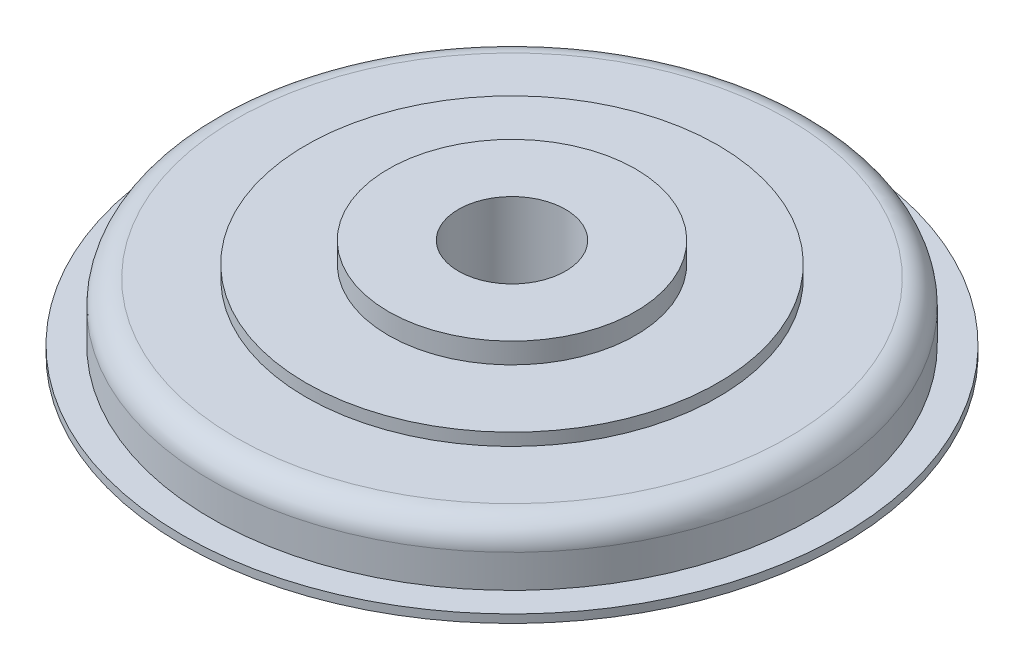
ISO-10303-21;
HEADER;
FILE_DESCRIPTION(('STEP AP214'),'2;1');
FILE_NAME('part.step','',(''),(''),'','','');
FILE_SCHEMA(('AUTOMOTIVE_DESIGN { 1 0 10303 214 1 1 1 1 }'));
ENDSEC;
DATA;
#1=APPLICATION_CONTEXT('core data for automotive mechanical design processes');
#2=APPLICATION_PROTOCOL_DEFINITION('international standard','automotive_design',2000,#1);
#3=PRODUCT_CONTEXT('',#1,'mechanical');
#4=PRODUCT('Part','Part','',(#3));
#5=PRODUCT_RELATED_PRODUCT_CATEGORY('part','',(#4));
#6=PRODUCT_DEFINITION_FORMATION('','',#4);
#7=PRODUCT_DEFINITION_CONTEXT('part definition',#1,'design');
#8=PRODUCT_DEFINITION('design','',#6,#7);
#9=PRODUCT_DEFINITION_SHAPE('','',#8);
#10=(LENGTH_UNIT() NAMED_UNIT(*) SI_UNIT(.MILLI.,.METRE.));
#11=(NAMED_UNIT(*) PLANE_ANGLE_UNIT() SI_UNIT($,.RADIAN.));
#12=(NAMED_UNIT(*) SI_UNIT($,.STERADIAN.) SOLID_ANGLE_UNIT());
#13=UNCERTAINTY_MEASURE_WITH_UNIT(LENGTH_MEASURE(1.E-05),#10,'distance_accuracy_value','');
#14=(GEOMETRIC_REPRESENTATION_CONTEXT(3) GLOBAL_UNCERTAINTY_ASSIGNED_CONTEXT((#13)) GLOBAL_UNIT_ASSIGNED_CONTEXT((#10,
#11,#12)) REPRESENTATION_CONTEXT('',''));
#15=CARTESIAN_POINT('',(0.,0.,0.));
#16=DIRECTION('',(0.,0.,1.));
#17=DIRECTION('',(1.,0.,0.));
#18=AXIS2_PLACEMENT_3D('',#15,#16,#17);
#19=CARTESIAN_POINT('',(0.,0.,0.));
#20=DIRECTION('',(0.,-1.,0.));
#21=DIRECTION('',(0.,0.,-1.));
#22=AXIS2_PLACEMENT_3D('',#19,#20,#21);
#23=PLANE('',#22);
#24=CARTESIAN_POINT('',(-200.,0.,0.));
#25=DIRECTION('',(0.,1.,0.));
#26=DIRECTION('',(0.,0.,1.));
#27=AXIS2_PLACEMENT_3D('',#24,#25,#26);
#28=CIRCLE('',#27,65.0000000000002);
#29=CARTESIAN_POINT('',(-200.,0.,65.0000000000002));
#30=VERTEX_POINT('',#29);
#31=EDGE_CURVE('E70',#30,#30,#28,.T.);
#32=ORIENTED_EDGE('',*,*,#31,.T.);
#33=EDGE_LOOP('',(#32));
#34=FACE_BOUND('',#33,.T.);
#35=CARTESIAN_POINT('',(-200.,0.,0.));
#36=DIRECTION('',(0.,-1.,0.));
#37=DIRECTION('',(0.,0.,-1.));
#38=AXIS2_PLACEMENT_3D('',#35,#36,#37);
#39=CIRCLE('',#38,400.);
#40=CARTESIAN_POINT('',(-200.,0.,-400.));
#41=VERTEX_POINT('',#40);
#42=EDGE_CURVE('E10',#41,#41,#39,.T.);
#43=ORIENTED_EDGE('',*,*,#42,.T.);
#44=EDGE_LOOP('',(#43));
#45=FACE_BOUND('',#44,.T.);
#46=ADVANCED_FACE('F33',(#34,#45),#23,.T.);
#47=CARTESIAN_POINT('',(-200.,-16.726974685066,0.));
#48=DIRECTION('',(0.,-1.,0.));
#49=DIRECTION('',(0.,0.,-1.));
#50=AXIS2_PLACEMENT_3D('',#47,#48,#49);
#51=CYLINDRICAL_SURFACE('',#50,400.);
#52=CARTESIAN_POINT('',(-200.,9.99999999999999,0.));
#53=DIRECTION('',(0.,-1.,0.));
#54=DIRECTION('',(0.,0.,-1.));
#55=AXIS2_PLACEMENT_3D('',#52,#53,#54);
#56=CIRCLE('',#55,400.);
#57=CARTESIAN_POINT('',(-200.,9.99999999999999,-400.));
#58=VERTEX_POINT('',#57);
#59=EDGE_CURVE('E39',#58,#58,#56,.T.);
#60=ORIENTED_EDGE('',*,*,#59,.T.);
#61=EDGE_LOOP('',(#60));
#62=FACE_BOUND('',#61,.T.);
#63=ORIENTED_EDGE('',*,*,#42,.F.);
#64=EDGE_LOOP('',(#63));
#65=FACE_BOUND('',#64,.T.);
#66=ADVANCED_FACE('F87',(#62,#65),#51,.T.);
#67=CARTESIAN_POINT('',(0.,9.99999999999999,0.));
#68=DIRECTION('',(0.,-1.,0.));
#69=DIRECTION('',(0.,0.,-1.));
#70=AXIS2_PLACEMENT_3D('',#67,#68,#69);
#71=PLANE('',#70);
#72=ORIENTED_EDGE('',*,*,#59,.F.);
#73=EDGE_LOOP('',(#72));
#74=FACE_BOUND('',#73,.T.);
#75=CARTESIAN_POINT('',(-200.,9.99999999999999,0.));
#76=DIRECTION('',(0.,-1.,0.));
#77=DIRECTION('',(0.,0.,-1.));
#78=AXIS2_PLACEMENT_3D('',#75,#76,#77);
#79=CIRCLE('',#78,365.);
#80=CARTESIAN_POINT('',(-200.,9.99999999999999,-365.));
#81=VERTEX_POINT('',#80);
#82=EDGE_CURVE('E43',#81,#81,#79,.T.);
#83=ORIENTED_EDGE('',*,*,#82,.T.);
#84=EDGE_LOOP('',(#83));
#85=FACE_BOUND('',#84,.T.);
#86=ADVANCED_FACE('F91',(#74,#85),#71,.F.);
#87=CARTESIAN_POINT('',(-200.,-16.726974685066,0.));
#88=DIRECTION('',(0.,-1.,0.));
#89=DIRECTION('',(0.,0.,-1.));
#90=AXIS2_PLACEMENT_3D('',#87,#88,#89);
#91=CYLINDRICAL_SURFACE('',#90,365.);
#92=CARTESIAN_POINT('',(-200.,50.0000000000002,0.));
#93=DIRECTION('',(0.,-1.,0.));
#94=DIRECTION('',(0.,0.,-1.));
#95=AXIS2_PLACEMENT_3D('',#92,#93,#94);
#96=CIRCLE('',#95,365.);
#97=CARTESIAN_POINT('',(-200.,50.0000000000002,-365.));
#98=VERTEX_POINT('',#97);
#99=EDGE_CURVE('E47',#98,#98,#96,.T.);
#100=ORIENTED_EDGE('',*,*,#99,.T.);
#101=EDGE_LOOP('',(#100));
#102=FACE_BOUND('',#101,.T.);
#103=ORIENTED_EDGE('',*,*,#82,.F.);
#104=EDGE_LOOP('',(#103));
#105=FACE_BOUND('',#104,.T.);
#106=ADVANCED_FACE('F95',(#102,#105),#91,.T.);
#107=CARTESIAN_POINT('',(-200.,50.0000000000002,0.));
#108=DIRECTION('',(0.,-1.,0.));
#109=DIRECTION('',(0.,0.,-1.));
#110=AXIS2_PLACEMENT_3D('',#107,#108,#109);
#111=TOROIDAL_SURFACE('',#110,335.,30.);
#112=ORIENTED_EDGE('',*,*,#99,.F.);
#113=EDGE_LOOP('',(#112));
#114=FACE_BOUND('',#113,.T.);
#115=CARTESIAN_POINT('',(-200.,80.0000000000002,0.));
#116=DIRECTION('',(0.,-1.,0.));
#117=DIRECTION('',(0.,0.,-1.));
#118=AXIS2_PLACEMENT_3D('',#115,#116,#117);
#119=CIRCLE('',#118,335.);
#120=CARTESIAN_POINT('',(-200.,80.0000000000002,-335.));
#121=VERTEX_POINT('',#120);
#122=EDGE_CURVE('E52',#121,#121,#119,.T.);
#123=ORIENTED_EDGE('',*,*,#122,.T.);
#124=EDGE_LOOP('',(#123));
#125=FACE_BOUND('',#124,.T.);
#126=ADVANCED_FACE('F102',(#114,#125),#111,.T.);
#127=CARTESIAN_POINT('',(0.,80.0000000000002,0.));
#128=DIRECTION('',(0.,-1.,0.));
#129=DIRECTION('',(0.,0.,-1.));
#130=AXIS2_PLACEMENT_3D('',#127,#128,#129);
#131=PLANE('',#130);
#132=ORIENTED_EDGE('',*,*,#122,.F.);
#133=EDGE_LOOP('',(#132));
#134=FACE_BOUND('',#133,.T.);
#135=CARTESIAN_POINT('',(-200.,80.0000000000002,0.));
#136=DIRECTION('',(0.,-1.,0.));
#137=DIRECTION('',(0.,0.,-1.));
#138=AXIS2_PLACEMENT_3D('',#135,#136,#137);
#139=CIRCLE('',#138,250.);
#140=CARTESIAN_POINT('',(-200.,80.0000000000002,-250.));
#141=VERTEX_POINT('',#140);
#142=EDGE_CURVE('E55',#141,#141,#139,.T.);
#143=ORIENTED_EDGE('',*,*,#142,.T.);
#144=EDGE_LOOP('',(#143));
#145=FACE_BOUND('',#144,.T.);
#146=ADVANCED_FACE('F106',(#134,#145),#131,.F.);
#147=CARTESIAN_POINT('',(-200.,-16.726974685066,0.));
#148=DIRECTION('',(0.,-1.,0.));
#149=DIRECTION('',(0.,0.,-1.));
#150=AXIS2_PLACEMENT_3D('',#147,#148,#149);
#151=CYLINDRICAL_SURFACE('',#150,250.);
#152=CARTESIAN_POINT('',(-200.,95.0000000000002,0.));
#153=DIRECTION('',(0.,-1.,0.));
#154=DIRECTION('',(0.,0.,-1.));
#155=AXIS2_PLACEMENT_3D('',#152,#153,#154);
#156=CIRCLE('',#155,250.);
#157=CARTESIAN_POINT('',(-200.,95.0000000000002,-250.));
#158=VERTEX_POINT('',#157);
#159=EDGE_CURVE('E58',#158,#158,#156,.T.);
#160=ORIENTED_EDGE('',*,*,#159,.T.);
#161=EDGE_LOOP('',(#160));
#162=FACE_BOUND('',#161,.T.);
#163=ORIENTED_EDGE('',*,*,#142,.F.);
#164=EDGE_LOOP('',(#163));
#165=FACE_BOUND('',#164,.T.);
#166=ADVANCED_FACE('F108',(#162,#165),#151,.T.);
#167=CARTESIAN_POINT('',(0.,95.0000000000002,0.));
#168=DIRECTION('',(0.,-1.,0.));
#169=DIRECTION('',(0.,0.,-1.));
#170=AXIS2_PLACEMENT_3D('',#167,#168,#169);
#171=PLANE('',#170);
#172=ORIENTED_EDGE('',*,*,#159,.F.);
#173=EDGE_LOOP('',(#172));
#174=FACE_BOUND('',#173,.T.);
#175=CARTESIAN_POINT('',(-200.,95.0000000000002,0.));
#176=DIRECTION('',(0.,-1.,0.));
#177=DIRECTION('',(0.,0.,-1.));
#178=AXIS2_PLACEMENT_3D('',#175,#176,#177);
#179=CIRCLE('',#178,150.);
#180=CARTESIAN_POINT('',(-200.,95.0000000000002,-150.));
#181=VERTEX_POINT('',#180);
#182=EDGE_CURVE('E61',#181,#181,#179,.F.);
#183=ORIENTED_EDGE('',*,*,#182,.F.);
#184=EDGE_LOOP('',(#183));
#185=FACE_BOUND('',#184,.T.);
#186=ADVANCED_FACE('F111',(#174,#185),#171,.F.);
#187=CARTESIAN_POINT('',(-200.,120.,0.));
#188=DIRECTION('',(0.,-1.,0.));
#189=DIRECTION('',(0.,0.,-1.));
#190=AXIS2_PLACEMENT_3D('',#187,#188,#189);
#191=CYLINDRICAL_SURFACE('',#190,150.);
#192=CARTESIAN_POINT('',(-200.,120.,0.));
#193=DIRECTION('',(0.,1.,0.));
#194=DIRECTION('',(0.,0.,1.));
#195=AXIS2_PLACEMENT_3D('',#192,#193,#194);
#196=CIRCLE('',#195,150.);
#197=CARTESIAN_POINT('',(-200.,120.,150.));
#198=VERTEX_POINT('',#197);
#199=EDGE_CURVE('E64',#198,#198,#196,.T.);
#200=ORIENTED_EDGE('',*,*,#199,.F.);
#201=EDGE_LOOP('',(#200));
#202=FACE_BOUND('',#201,.T.);
#203=ORIENTED_EDGE('',*,*,#182,.T.);
#204=EDGE_LOOP('',(#203));
#205=FACE_BOUND('',#204,.T.);
#206=ADVANCED_FACE('F83',(#202,#205),#191,.T.);
#207=CARTESIAN_POINT('',(-200.,120.,0.));
#208=DIRECTION('',(0.,1.,0.));
#209=DIRECTION('',(0.,0.,1.));
#210=AXIS2_PLACEMENT_3D('',#207,#208,#209);
#211=PLANE('',#210);
#212=ORIENTED_EDGE('',*,*,#199,.T.);
#213=EDGE_LOOP('',(#212));
#214=FACE_BOUND('',#213,.T.);
#215=CARTESIAN_POINT('',(-200.,120.,0.));
#216=DIRECTION('',(0.,1.,0.));
#217=DIRECTION('',(0.,0.,1.));
#218=AXIS2_PLACEMENT_3D('',#215,#216,#217);
#219=CIRCLE('',#218,65.0000000000002);
#220=CARTESIAN_POINT('',(-200.,120.,65.0000000000002));
#221=VERTEX_POINT('',#220);
#222=EDGE_CURVE('E67',#221,#221,#219,.T.);
#223=ORIENTED_EDGE('',*,*,#222,.F.);
#224=EDGE_LOOP('',(#223));
#225=FACE_BOUND('',#224,.T.);
#226=ADVANCED_FACE('F77',(#214,#225),#211,.T.);
#227=CARTESIAN_POINT('',(-200.,120.,0.));
#228=DIRECTION('',(0.,-1.,0.));
#229=DIRECTION('',(0.,0.,-1.));
#230=AXIS2_PLACEMENT_3D('',#227,#228,#229);
#231=CYLINDRICAL_SURFACE('',#230,65.0000000000002);
#232=ORIENTED_EDGE('',*,*,#222,.T.);
#233=EDGE_LOOP('',(#232));
#234=FACE_BOUND('',#233,.T.);
#235=ORIENTED_EDGE('',*,*,#31,.F.);
#236=EDGE_LOOP('',(#235));
#237=FACE_BOUND('',#236,.T.);
#238=ADVANCED_FACE('F75',(#234,#237),#231,.F.);
#239=CLOSED_SHELL('',(#46,#66,#86,#106,#126,#146,#166,#186,#206,#226,#238));
#240=MANIFOLD_SOLID_BREP('B2',#239);
#241=ADVANCED_BREP_SHAPE_REPRESENTATION('',(#18,#240),#14);
#242=SHAPE_DEFINITION_REPRESENTATION(#9,#241);
ENDSEC;
END-ISO-10303-21;
